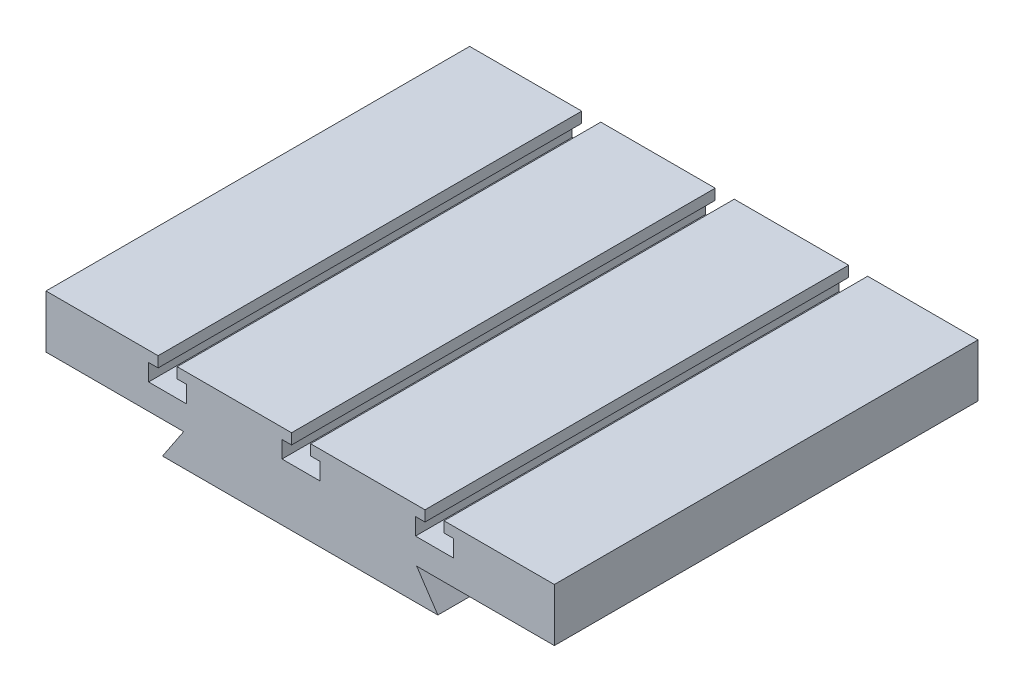
ISO-10303-21;
HEADER;
FILE_DESCRIPTION(('STEP AP214'),'2;1');
FILE_NAME('part.step','',(''),(''),'','','');
FILE_SCHEMA(('AUTOMOTIVE_DESIGN { 1 0 10303 214 1 1 1 1 }'));
ENDSEC;
DATA;
#1=APPLICATION_CONTEXT('core data for automotive mechanical design processes');
#2=APPLICATION_PROTOCOL_DEFINITION('international standard','automotive_design',2000,#1);
#3=PRODUCT_CONTEXT('',#1,'mechanical');
#4=PRODUCT('Part','Part','',(#3));
#5=PRODUCT_RELATED_PRODUCT_CATEGORY('part','',(#4));
#6=PRODUCT_DEFINITION_FORMATION('','',#4);
#7=PRODUCT_DEFINITION_CONTEXT('part definition',#1,'design');
#8=PRODUCT_DEFINITION('design','',#6,#7);
#9=PRODUCT_DEFINITION_SHAPE('','',#8);
#10=(LENGTH_UNIT() NAMED_UNIT(*) SI_UNIT(.MILLI.,.METRE.));
#11=(NAMED_UNIT(*) PLANE_ANGLE_UNIT() SI_UNIT($,.RADIAN.));
#12=(NAMED_UNIT(*) SI_UNIT($,.STERADIAN.) SOLID_ANGLE_UNIT());
#13=UNCERTAINTY_MEASURE_WITH_UNIT(LENGTH_MEASURE(1.E-05),#10,'distance_accuracy_value','');
#14=(GEOMETRIC_REPRESENTATION_CONTEXT(3) GLOBAL_UNCERTAINTY_ASSIGNED_CONTEXT((#13)) GLOBAL_UNIT_ASSIGNED_CONTEXT((#10,
#11,#12)) REPRESENTATION_CONTEXT('',''));
#15=CARTESIAN_POINT('',(0.,0.,0.));
#16=DIRECTION('',(0.,0.,1.));
#17=DIRECTION('',(1.,0.,0.));
#18=AXIS2_PLACEMENT_3D('',#15,#16,#17);
#19=CARTESIAN_POINT('',(-120.,40.,200.));
#20=DIRECTION('',(0.,-1.,0.));
#21=DIRECTION('',(0.,0.,-1.));
#22=AXIS2_PLACEMENT_3D('',#19,#20,#21);
#23=PLANE('',#22);
#24=DIRECTION('',(-1.,0.,0.));
#25=VECTOR('',#24,1.);
#26=CARTESIAN_POINT('',(120.,40.,200.));
#27=LINE('',#26,#25);
#28=CARTESIAN_POINT('',(58.9261789790718,40.,200.));
#29=VERTEX_POINT('',#28);
#30=CARTESIAN_POINT('',(4.92617897907182,40.,200.));
#31=VERTEX_POINT('',#30);
#32=EDGE_CURVE('E437',#29,#31,#27,.T.);
#33=ORIENTED_EDGE('',*,*,#32,.F.);
#34=DIRECTION('',(0.,0.,1.));
#35=VECTOR('',#34,1.);
#36=CARTESIAN_POINT('',(58.9261789790718,40.,0.));
#37=LINE('',#36,#35);
#38=CARTESIAN_POINT('',(58.9261789790718,40.,0.));
#39=VERTEX_POINT('',#38);
#40=EDGE_CURVE('E357',#39,#29,#37,.T.);
#41=ORIENTED_EDGE('',*,*,#40,.F.);
#42=DIRECTION('',(-1.,0.,0.));
#43=VECTOR('',#42,1.);
#44=CARTESIAN_POINT('',(-120.,40.,0.));
#45=LINE('',#44,#43);
#46=CARTESIAN_POINT('',(4.92617897907182,40.,0.));
#47=VERTEX_POINT('',#46);
#48=EDGE_CURVE('E457',#39,#47,#45,.T.);
#49=ORIENTED_EDGE('',*,*,#48,.T.);
#50=DIRECTION('',(0.,0.,1.));
#51=VECTOR('',#50,1.);
#52=CARTESIAN_POINT('',(4.92617897907182,40.,0.));
#53=LINE('',#52,#51);
#54=EDGE_CURVE('E417',#47,#31,#53,.T.);
#55=ORIENTED_EDGE('',*,*,#54,.T.);
#56=EDGE_LOOP('',(#33,#41,#49,#55));
#57=FACE_BOUND('',#56,.T.);
#58=ADVANCED_FACE('F34',(#57),#23,.F.);
#59=CARTESIAN_POINT('',(-67.0738210209282,39.9999999999987,200.));
#60=VERTEX_POINT('',#59);
#61=CARTESIAN_POINT('',(-120.,40.,200.));
#62=VERTEX_POINT('',#61);
#63=EDGE_CURVE('E432',#60,#62,#27,.T.);
#64=ORIENTED_EDGE('',*,*,#63,.F.);
#65=DIRECTION('',(0.,0.,1.));
#66=VECTOR('',#65,1.);
#67=CARTESIAN_POINT('',(-67.0738210209282,39.9999999999987,0.));
#68=LINE('',#67,#66);
#69=CARTESIAN_POINT('',(-67.0738210209282,39.9999999999987,0.));
#70=VERTEX_POINT('',#69);
#71=EDGE_CURVE('E305',#70,#60,#68,.T.);
#72=ORIENTED_EDGE('',*,*,#71,.F.);
#73=CARTESIAN_POINT('',(-120.,40.,0.));
#74=VERTEX_POINT('',#73);
#75=EDGE_CURVE('E452',#70,#74,#45,.T.);
#76=ORIENTED_EDGE('',*,*,#75,.T.);
#77=DIRECTION('',(0.,0.,-1.));
#78=VECTOR('',#77,1.);
#79=CARTESIAN_POINT('',(-120.,40.,200.));
#80=LINE('',#79,#78);
#81=EDGE_CURVE('E471',#62,#74,#80,.T.);
#82=ORIENTED_EDGE('',*,*,#81,.F.);
#83=EDGE_LOOP('',(#64,#72,#76,#82));
#84=FACE_BOUND('',#83,.T.);
#85=ADVANCED_FACE('F525',(#84),#23,.F.);
#86=CARTESIAN_POINT('',(-4.07382102092818,40.,0.));
#87=VERTEX_POINT('',#86);
#88=CARTESIAN_POINT('',(-58.0738210209282,39.9999999999987,0.));
#89=VERTEX_POINT('',#88);
#90=EDGE_CURVE('E527',#87,#89,#45,.T.);
#91=ORIENTED_EDGE('',*,*,#90,.T.);
#92=DIRECTION('',(0.,0.,1.));
#93=VECTOR('',#92,1.);
#94=CARTESIAN_POINT('',(-58.0738210209282,39.9999999999987,0.));
#95=LINE('',#94,#93);
#96=CARTESIAN_POINT('',(-58.0738210209282,39.9999999999987,200.));
#97=VERTEX_POINT('',#96);
#98=EDGE_CURVE('E307',#89,#97,#95,.T.);
#99=ORIENTED_EDGE('',*,*,#98,.T.);
#100=CARTESIAN_POINT('',(-4.07382102092818,40.,200.));
#101=VERTEX_POINT('',#100);
#102=EDGE_CURVE('E548',#101,#97,#27,.T.);
#103=ORIENTED_EDGE('',*,*,#102,.F.);
#104=DIRECTION('',(0.,0.,1.));
#105=VECTOR('',#104,1.);
#106=CARTESIAN_POINT('',(-4.07382102092818,40.,0.));
#107=LINE('',#106,#105);
#108=EDGE_CURVE('E415',#87,#101,#107,.T.);
#109=ORIENTED_EDGE('',*,*,#108,.F.);
#110=EDGE_LOOP('',(#91,#99,#103,#109));
#111=FACE_BOUND('',#110,.T.);
#112=ADVANCED_FACE('F568',(#111),#23,.F.);
#113=CARTESIAN_POINT('',(0.,0.,200.));
#114=DIRECTION('',(0.,1.,0.));
#115=DIRECTION('',(-1.,0.,0.));
#116=AXIS2_PLACEMENT_3D('',#113,#114,#115);
#117=PLANE('',#116);
#118=DIRECTION('',(1.,0.,0.));
#119=VECTOR('',#118,1.);
#120=CARTESIAN_POINT('',(0.,0.,0.));
#121=LINE('',#120,#119);
#122=CARTESIAN_POINT('',(-65.,0.,0.));
#123=VERTEX_POINT('',#122);
#124=CARTESIAN_POINT('',(65.,0.,0.));
#125=VERTEX_POINT('',#124);
#126=EDGE_CURVE('E408',#123,#125,#121,.T.);
#127=ORIENTED_EDGE('',*,*,#126,.T.);
#128=DIRECTION('',(0.,0.,-1.));
#129=VECTOR('',#128,1.);
#130=CARTESIAN_POINT('',(65.,0.,200.));
#131=LINE('',#130,#129);
#132=CARTESIAN_POINT('',(65.,0.,200.));
#133=VERTEX_POINT('',#132);
#134=EDGE_CURVE('E11',#133,#125,#131,.T.);
#135=ORIENTED_EDGE('',*,*,#134,.F.);
#136=DIRECTION('',(1.,0.,0.));
#137=VECTOR('',#136,1.);
#138=CARTESIAN_POINT('',(0.,0.,200.));
#139=LINE('',#138,#137);
#140=CARTESIAN_POINT('',(-65.,0.,200.));
#141=VERTEX_POINT('',#140);
#142=EDGE_CURVE('E423',#141,#133,#139,.T.);
#143=ORIENTED_EDGE('',*,*,#142,.F.);
#144=DIRECTION('',(0.,0.,-1.));
#145=VECTOR('',#144,1.);
#146=CARTESIAN_POINT('',(-65.,0.,200.));
#147=LINE('',#146,#145);
#148=EDGE_CURVE('E443',#141,#123,#147,.T.);
#149=ORIENTED_EDGE('',*,*,#148,.T.);
#150=EDGE_LOOP('',(#127,#135,#143,#149));
#151=FACE_BOUND('',#150,.T.);
#152=ADVANCED_FACE('F36',(#151),#117,.F.);
#153=CARTESIAN_POINT('',(65.,0.,200.));
#154=DIRECTION('',(-0.832050294337843,-0.554700196225229,0.));
#155=DIRECTION('',(0.554700196225229,-0.832050294337844,0.));
#156=AXIS2_PLACEMENT_3D('',#153,#154,#155);
#157=PLANE('',#156);
#158=DIRECTION('',(-0.554700196225229,0.832050294337843,0.));
#159=VECTOR('',#158,1.);
#160=CARTESIAN_POINT('',(65.,0.,0.));
#161=LINE('',#160,#159);
#162=CARTESIAN_POINT('',(55.,15.,0.));
#163=VERTEX_POINT('',#162);
#164=EDGE_CURVE('E445',#125,#163,#161,.T.);
#165=ORIENTED_EDGE('',*,*,#164,.T.);
#166=DIRECTION('',(0.,0.,-1.));
#167=VECTOR('',#166,1.);
#168=CARTESIAN_POINT('',(55.,15.,200.));
#169=LINE('',#168,#167);
#170=CARTESIAN_POINT('',(55.,15.,200.));
#171=VERTEX_POINT('',#170);
#172=EDGE_CURVE('E42',#171,#163,#169,.T.);
#173=ORIENTED_EDGE('',*,*,#172,.F.);
#174=DIRECTION('',(-0.554700196225229,0.832050294337843,0.));
#175=VECTOR('',#174,1.);
#176=CARTESIAN_POINT('',(65.,0.,200.));
#177=LINE('',#176,#175);
#178=EDGE_CURVE('E425',#133,#171,#177,.T.);
#179=ORIENTED_EDGE('',*,*,#178,.F.);
#180=ORIENTED_EDGE('',*,*,#134,.T.);
#181=EDGE_LOOP('',(#165,#173,#179,#180));
#182=FACE_BOUND('',#181,.T.);
#183=ADVANCED_FACE('F504',(#182),#157,.F.);
#184=CARTESIAN_POINT('',(55.,15.,200.));
#185=DIRECTION('',(0.,1.,0.));
#186=DIRECTION('',(-1.,0.,0.));
#187=AXIS2_PLACEMENT_3D('',#184,#185,#186);
#188=PLANE('',#187);
#189=DIRECTION('',(1.,0.,0.));
#190=VECTOR('',#189,1.);
#191=CARTESIAN_POINT('',(55.,15.,0.));
#192=LINE('',#191,#190);
#193=CARTESIAN_POINT('',(120.,15.,0.));
#194=VERTEX_POINT('',#193);
#195=EDGE_CURVE('E447',#163,#194,#192,.T.);
#196=ORIENTED_EDGE('',*,*,#195,.T.);
#197=DIRECTION('',(0.,0.,-1.));
#198=VECTOR('',#197,1.);
#199=CARTESIAN_POINT('',(120.,15.,200.));
#200=LINE('',#199,#198);
#201=CARTESIAN_POINT('',(120.,15.,200.));
#202=VERTEX_POINT('',#201);
#203=EDGE_CURVE('E477',#202,#194,#200,.T.);
#204=ORIENTED_EDGE('',*,*,#203,.F.);
#205=DIRECTION('',(1.,0.,0.));
#206=VECTOR('',#205,1.);
#207=CARTESIAN_POINT('',(55.,15.,200.));
#208=LINE('',#207,#206);
#209=EDGE_CURVE('E428',#171,#202,#208,.T.);
#210=ORIENTED_EDGE('',*,*,#209,.F.);
#211=ORIENTED_EDGE('',*,*,#172,.T.);
#212=EDGE_LOOP('',(#196,#204,#210,#211));
#213=FACE_BOUND('',#212,.T.);
#214=ADVANCED_FACE('F484',(#213),#188,.F.);
#215=CARTESIAN_POINT('',(120.,15.,200.));
#216=DIRECTION('',(-1.,0.,0.));
#217=DIRECTION('',(0.,-1.,0.));
#218=AXIS2_PLACEMENT_3D('',#215,#216,#217);
#219=PLANE('',#218);
#220=DIRECTION('',(0.,1.,0.));
#221=VECTOR('',#220,1.);
#222=CARTESIAN_POINT('',(120.,15.,0.));
#223=LINE('',#222,#221);
#224=CARTESIAN_POINT('',(120.,40.,0.));
#225=VERTEX_POINT('',#224);
#226=EDGE_CURVE('E449',#194,#225,#223,.T.);
#227=ORIENTED_EDGE('',*,*,#226,.T.);
#228=DIRECTION('',(0.,0.,-1.));
#229=VECTOR('',#228,1.);
#230=CARTESIAN_POINT('',(120.,40.,200.));
#231=LINE('',#230,#229);
#232=CARTESIAN_POINT('',(120.,40.,200.));
#233=VERTEX_POINT('',#232);
#234=EDGE_CURVE('E474',#233,#225,#231,.T.);
#235=ORIENTED_EDGE('',*,*,#234,.F.);
#236=DIRECTION('',(0.,1.,0.));
#237=VECTOR('',#236,1.);
#238=CARTESIAN_POINT('',(120.,15.,200.));
#239=LINE('',#238,#237);
#240=EDGE_CURVE('E430',#202,#233,#239,.T.);
#241=ORIENTED_EDGE('',*,*,#240,.F.);
#242=ORIENTED_EDGE('',*,*,#203,.T.);
#243=EDGE_LOOP('',(#227,#235,#241,#242));
#244=FACE_BOUND('',#243,.T.);
#245=ADVANCED_FACE('F492',(#244),#219,.F.);
#246=CARTESIAN_POINT('',(67.9261789790718,40.,0.));
#247=VERTEX_POINT('',#246);
#248=EDGE_CURVE('E453',#225,#247,#45,.T.);
#249=ORIENTED_EDGE('',*,*,#248,.T.);
#250=DIRECTION('',(0.,0.,1.));
#251=VECTOR('',#250,1.);
#252=CARTESIAN_POINT('',(67.9261789790718,40.,0.));
#253=LINE('',#252,#251);
#254=CARTESIAN_POINT('',(67.9261789790718,40.,200.));
#255=VERTEX_POINT('',#254);
#256=EDGE_CURVE('E359',#247,#255,#253,.T.);
#257=ORIENTED_EDGE('',*,*,#256,.T.);
#258=EDGE_CURVE('E433',#233,#255,#27,.T.);
#259=ORIENTED_EDGE('',*,*,#258,.F.);
#260=ORIENTED_EDGE('',*,*,#234,.T.);
#261=EDGE_LOOP('',(#249,#257,#259,#260));
#262=FACE_BOUND('',#261,.T.);
#263=ADVANCED_FACE('F496',(#262),#23,.F.);
#264=CARTESIAN_POINT('',(-120.,15.,200.));
#265=DIRECTION('',(1.,0.,0.));
#266=DIRECTION('',(0.,1.,0.));
#267=AXIS2_PLACEMENT_3D('',#264,#265,#266);
#268=PLANE('',#267);
#269=DIRECTION('',(0.,-1.,0.));
#270=VECTOR('',#269,1.);
#271=CARTESIAN_POINT('',(-120.,15.,0.));
#272=LINE('',#271,#270);
#273=CARTESIAN_POINT('',(-120.,15.,0.));
#274=VERTEX_POINT('',#273);
#275=EDGE_CURVE('E456',#74,#274,#272,.T.);
#276=ORIENTED_EDGE('',*,*,#275,.T.);
#277=DIRECTION('',(0.,0.,-1.));
#278=VECTOR('',#277,1.);
#279=CARTESIAN_POINT('',(-120.,15.,200.));
#280=LINE('',#279,#278);
#281=CARTESIAN_POINT('',(-120.,15.,200.));
#282=VERTEX_POINT('',#281);
#283=EDGE_CURVE('E468',#282,#274,#280,.T.);
#284=ORIENTED_EDGE('',*,*,#283,.F.);
#285=DIRECTION('',(0.,-1.,0.));
#286=VECTOR('',#285,1.);
#287=CARTESIAN_POINT('',(-120.,15.,200.));
#288=LINE('',#287,#286);
#289=EDGE_CURVE('E436',#62,#282,#288,.T.);
#290=ORIENTED_EDGE('',*,*,#289,.F.);
#291=ORIENTED_EDGE('',*,*,#81,.T.);
#292=EDGE_LOOP('',(#276,#284,#290,#291));
#293=FACE_BOUND('',#292,.T.);
#294=ADVANCED_FACE('F520',(#293),#268,.F.);
#295=CARTESIAN_POINT('',(-55.,15.,200.));
#296=DIRECTION('',(0.,1.,0.));
#297=DIRECTION('',(-1.,0.,0.));
#298=AXIS2_PLACEMENT_3D('',#295,#296,#297);
#299=PLANE('',#298);
#300=DIRECTION('',(1.,0.,0.));
#301=VECTOR('',#300,1.);
#302=CARTESIAN_POINT('',(-55.,15.,0.));
#303=LINE('',#302,#301);
#304=CARTESIAN_POINT('',(-55.,15.,0.));
#305=VERTEX_POINT('',#304);
#306=EDGE_CURVE('E459',#274,#305,#303,.T.);
#307=ORIENTED_EDGE('',*,*,#306,.T.);
#308=DIRECTION('',(0.,0.,-1.));
#309=VECTOR('',#308,1.);
#310=CARTESIAN_POINT('',(-55.,15.,200.));
#311=LINE('',#310,#309);
#312=CARTESIAN_POINT('',(-55.,15.,200.));
#313=VERTEX_POINT('',#312);
#314=EDGE_CURVE('E465',#313,#305,#311,.T.);
#315=ORIENTED_EDGE('',*,*,#314,.F.);
#316=DIRECTION('',(1.,0.,0.));
#317=VECTOR('',#316,1.);
#318=CARTESIAN_POINT('',(-55.,15.,200.));
#319=LINE('',#318,#317);
#320=EDGE_CURVE('E439',#282,#313,#319,.T.);
#321=ORIENTED_EDGE('',*,*,#320,.F.);
#322=ORIENTED_EDGE('',*,*,#283,.T.);
#323=EDGE_LOOP('',(#307,#315,#321,#322));
#324=FACE_BOUND('',#323,.T.);
#325=ADVANCED_FACE('F515',(#324),#299,.F.);
#326=CARTESIAN_POINT('',(-65.,0.,200.));
#327=DIRECTION('',(0.832050294337844,-0.554700196225228,0.));
#328=DIRECTION('',(0.554700196225228,0.832050294337844,0.));
#329=AXIS2_PLACEMENT_3D('',#326,#327,#328);
#330=PLANE('',#329);
#331=DIRECTION('',(-0.554700196225228,-0.832050294337844,0.));
#332=VECTOR('',#331,1.);
#333=CARTESIAN_POINT('',(-65.,0.,0.));
#334=LINE('',#333,#332);
#335=EDGE_CURVE('E426',#305,#123,#334,.T.);
#336=ORIENTED_EDGE('',*,*,#335,.T.);
#337=ORIENTED_EDGE('',*,*,#148,.F.);
#338=DIRECTION('',(-0.554700196225228,-0.832050294337844,0.));
#339=VECTOR('',#338,1.);
#340=CARTESIAN_POINT('',(-65.,0.,200.));
#341=LINE('',#340,#339);
#342=EDGE_CURVE('E441',#313,#141,#341,.T.);
#343=ORIENTED_EDGE('',*,*,#342,.F.);
#344=ORIENTED_EDGE('',*,*,#314,.T.);
#345=EDGE_LOOP('',(#336,#337,#343,#344));
#346=FACE_BOUND('',#345,.T.);
#347=ADVANCED_FACE('F510',(#346),#330,.F.);
#348=CARTESIAN_POINT('',(0.,0.,200.));
#349=DIRECTION('',(0.,0.,-1.));
#350=DIRECTION('',(-1.,0.,0.));
#351=AXIS2_PLACEMENT_3D('',#348,#349,#350);
#352=PLANE('',#351);
#353=DIRECTION('',(-1.,0.,0.));
#354=VECTOR('',#353,1.);
#355=CARTESIAN_POINT('',(58.9261789790718,35.,200.));
#356=LINE('',#355,#354);
#357=CARTESIAN_POINT('',(58.9261789790718,35.,200.));
#358=VERTEX_POINT('',#357);
#359=CARTESIAN_POINT('',(54.4261789790718,35.,200.));
#360=VERTEX_POINT('',#359);
#361=EDGE_CURVE('E342',#358,#360,#356,.T.);
#362=ORIENTED_EDGE('',*,*,#361,.F.);
#363=DIRECTION('',(0.,-1.,0.));
#364=VECTOR('',#363,1.);
#365=CARTESIAN_POINT('',(58.9261789790718,40.,200.));
#366=LINE('',#365,#364);
#367=EDGE_CURVE('E339',#29,#358,#366,.T.);
#368=ORIENTED_EDGE('',*,*,#367,.F.);
#369=ORIENTED_EDGE('',*,*,#32,.T.);
#370=DIRECTION('',(0.,1.,0.));
#371=VECTOR('',#370,1.);
#372=CARTESIAN_POINT('',(4.92617897907182,35.,200.));
#373=LINE('',#372,#371);
#374=CARTESIAN_POINT('',(4.92617897907182,35.,200.));
#375=VERTEX_POINT('',#374);
#376=EDGE_CURVE('E393',#375,#31,#373,.T.);
#377=ORIENTED_EDGE('',*,*,#376,.F.);
#378=DIRECTION('',(-1.,0.,0.));
#379=VECTOR('',#378,1.);
#380=CARTESIAN_POINT('',(9.42617897907182,35.,200.));
#381=LINE('',#380,#379);
#382=CARTESIAN_POINT('',(9.42617897907182,35.,200.));
#383=VERTEX_POINT('',#382);
#384=EDGE_CURVE('E390',#383,#375,#381,.T.);
#385=ORIENTED_EDGE('',*,*,#384,.F.);
#386=DIRECTION('',(0.,1.,0.));
#387=VECTOR('',#386,1.);
#388=CARTESIAN_POINT('',(9.42617897907182,27.,200.));
#389=LINE('',#388,#387);
#390=CARTESIAN_POINT('',(9.42617897907182,27.,200.));
#391=VERTEX_POINT('',#390);
#392=EDGE_CURVE('E298',#391,#383,#389,.T.);
#393=ORIENTED_EDGE('',*,*,#392,.F.);
#394=DIRECTION('',(1.,0.,0.));
#395=VECTOR('',#394,1.);
#396=CARTESIAN_POINT('',(-8.57382102092818,27.,200.));
#397=LINE('',#396,#395);
#398=CARTESIAN_POINT('',(-8.57382102092818,27.,200.));
#399=VERTEX_POINT('',#398);
#400=EDGE_CURVE('E369',#399,#391,#397,.T.);
#401=ORIENTED_EDGE('',*,*,#400,.F.);
#402=DIRECTION('',(0.,-1.,0.));
#403=VECTOR('',#402,1.);
#404=CARTESIAN_POINT('',(-8.57382102092819,35.,200.));
#405=LINE('',#404,#403);
#406=CARTESIAN_POINT('',(-8.57382102092819,35.,200.));
#407=VERTEX_POINT('',#406);
#408=EDGE_CURVE('E401',#407,#399,#405,.T.);
#409=ORIENTED_EDGE('',*,*,#408,.F.);
#410=DIRECTION('',(-1.,0.,0.));
#411=VECTOR('',#410,1.);
#412=CARTESIAN_POINT('',(-4.07382102092818,35.,200.));
#413=LINE('',#412,#411);
#414=CARTESIAN_POINT('',(-4.07382102092818,35.,200.));
#415=VERTEX_POINT('',#414);
#416=EDGE_CURVE('E398',#415,#407,#413,.T.);
#417=ORIENTED_EDGE('',*,*,#416,.F.);
#418=DIRECTION('',(0.,-1.,0.));
#419=VECTOR('',#418,1.);
#420=CARTESIAN_POINT('',(-4.07382102092818,40.,200.));
#421=LINE('',#420,#419);
#422=EDGE_CURVE('E395',#101,#415,#421,.T.);
#423=ORIENTED_EDGE('',*,*,#422,.F.);
#424=ORIENTED_EDGE('',*,*,#102,.T.);
#425=DIRECTION('',(0.,1.,0.));
#426=VECTOR('',#425,1.);
#427=CARTESIAN_POINT('',(-58.0738210209282,34.9999999999987,200.));
#428=LINE('',#427,#426);
#429=CARTESIAN_POINT('',(-58.0738210209282,34.9999999999987,200.));
#430=VERTEX_POINT('',#429);
#431=EDGE_CURVE('E286',#430,#97,#428,.T.);
#432=ORIENTED_EDGE('',*,*,#431,.F.);
#433=DIRECTION('',(-1.,0.,0.));
#434=VECTOR('',#433,1.);
#435=CARTESIAN_POINT('',(-53.5738210209282,34.9999999999987,200.));
#436=LINE('',#435,#434);
#437=CARTESIAN_POINT('',(-53.5738210209282,34.9999999999987,200.));
#438=VERTEX_POINT('',#437);
#439=EDGE_CURVE('E283',#438,#430,#436,.T.);
#440=ORIENTED_EDGE('',*,*,#439,.F.);
#441=DIRECTION('',(0.,1.,0.));
#442=VECTOR('',#441,1.);
#443=CARTESIAN_POINT('',(-53.5738210209282,26.9999999999987,200.));
#444=LINE('',#443,#442);
#445=CARTESIAN_POINT('',(-53.5738210209282,26.9999999999987,200.));
#446=VERTEX_POINT('',#445);
#447=EDGE_CURVE('E250',#446,#438,#444,.T.);
#448=ORIENTED_EDGE('',*,*,#447,.F.);
#449=DIRECTION('',(1.,0.,0.));
#450=VECTOR('',#449,1.);
#451=CARTESIAN_POINT('',(-71.5738210209282,26.9999999999987,200.));
#452=LINE('',#451,#450);
#453=CARTESIAN_POINT('',(-71.5738210209282,26.9999999999987,200.));
#454=VERTEX_POINT('',#453);
#455=EDGE_CURVE('E266',#454,#446,#452,.T.);
#456=ORIENTED_EDGE('',*,*,#455,.F.);
#457=DIRECTION('',(0.,-1.,0.));
#458=VECTOR('',#457,1.);
#459=CARTESIAN_POINT('',(-71.5738210209282,34.9999999999987,200.));
#460=LINE('',#459,#458);
#461=CARTESIAN_POINT('',(-71.5738210209282,34.9999999999987,200.));
#462=VERTEX_POINT('',#461);
#463=EDGE_CURVE('E269',#462,#454,#460,.T.);
#464=ORIENTED_EDGE('',*,*,#463,.F.);
#465=DIRECTION('',(-1.,0.,0.));
#466=VECTOR('',#465,1.);
#467=CARTESIAN_POINT('',(-67.0738210209282,34.9999999999987,200.));
#468=LINE('',#467,#466);
#469=CARTESIAN_POINT('',(-67.0738210209282,34.9999999999987,200.));
#470=VERTEX_POINT('',#469);
#471=EDGE_CURVE('E291',#470,#462,#468,.T.);
#472=ORIENTED_EDGE('',*,*,#471,.F.);
#473=DIRECTION('',(0.,-1.,0.));
#474=VECTOR('',#473,1.);
#475=CARTESIAN_POINT('',(-67.0738210209282,39.9999999999987,200.));
#476=LINE('',#475,#474);
#477=EDGE_CURVE('E288',#60,#470,#476,.T.);
#478=ORIENTED_EDGE('',*,*,#477,.F.);
#479=ORIENTED_EDGE('',*,*,#63,.T.);
#480=ORIENTED_EDGE('',*,*,#289,.T.);
#481=ORIENTED_EDGE('',*,*,#320,.T.);
#482=ORIENTED_EDGE('',*,*,#342,.T.);
#483=ORIENTED_EDGE('',*,*,#142,.T.);
#484=ORIENTED_EDGE('',*,*,#178,.T.);
#485=ORIENTED_EDGE('',*,*,#209,.T.);
#486=ORIENTED_EDGE('',*,*,#240,.T.);
#487=ORIENTED_EDGE('',*,*,#258,.T.);
#488=DIRECTION('',(0.,1.,0.));
#489=VECTOR('',#488,1.);
#490=CARTESIAN_POINT('',(67.9261789790718,35.,200.));
#491=LINE('',#490,#489);
#492=CARTESIAN_POINT('',(67.9261789790718,35.,200.));
#493=VERTEX_POINT('',#492);
#494=EDGE_CURVE('E337',#493,#255,#491,.T.);
#495=ORIENTED_EDGE('',*,*,#494,.F.);
#496=DIRECTION('',(-1.,0.,0.));
#497=VECTOR('',#496,1.);
#498=CARTESIAN_POINT('',(72.4261789790718,35.,200.));
#499=LINE('',#498,#497);
#500=CARTESIAN_POINT('',(72.4261789790718,35.,200.));
#501=VERTEX_POINT('',#500);
#502=EDGE_CURVE('E334',#501,#493,#499,.T.);
#503=ORIENTED_EDGE('',*,*,#502,.F.);
#504=DIRECTION('',(0.,1.,0.));
#505=VECTOR('',#504,1.);
#506=CARTESIAN_POINT('',(72.4261789790718,27.,200.));
#507=LINE('',#506,#505);
#508=CARTESIAN_POINT('',(72.4261789790718,27.,200.));
#509=VERTEX_POINT('',#508);
#510=EDGE_CURVE('E331',#509,#501,#507,.T.);
#511=ORIENTED_EDGE('',*,*,#510,.F.);
#512=DIRECTION('',(1.,0.,0.));
#513=VECTOR('',#512,1.);
#514=CARTESIAN_POINT('',(54.4261789790718,27.,200.));
#515=LINE('',#514,#513);
#516=CARTESIAN_POINT('',(54.4261789790718,27.,200.));
#517=VERTEX_POINT('',#516);
#518=EDGE_CURVE('E315',#517,#509,#515,.T.);
#519=ORIENTED_EDGE('',*,*,#518,.F.);
#520=DIRECTION('',(0.,-1.,0.));
#521=VECTOR('',#520,1.);
#522=CARTESIAN_POINT('',(54.4261789790718,35.,200.));
#523=LINE('',#522,#521);
#524=EDGE_CURVE('E345',#360,#517,#523,.T.);
#525=ORIENTED_EDGE('',*,*,#524,.F.);
#526=EDGE_LOOP('',(#362,#368,#369,#377,#385,#393,#401,#409,#417,#423,#424,#432,#440,#448,#456,
#464,#472,#478,#479,#480,#481,#482,#483,#484,#485,#486,#487,#495,#503,#511,#519,#525));
#527=FACE_BOUND('',#526,.T.);
#528=ADVANCED_FACE('F500',(#527),#352,.F.);
#529=CARTESIAN_POINT('',(0.,0.,0.));
#530=DIRECTION('',(0.,0.,-1.));
#531=DIRECTION('',(-1.,0.,0.));
#532=AXIS2_PLACEMENT_3D('',#529,#530,#531);
#533=PLANE('',#532);
#534=DIRECTION('',(0.,-1.,0.));
#535=VECTOR('',#534,1.);
#536=CARTESIAN_POINT('',(58.9261789790718,40.,0.));
#537=LINE('',#536,#535);
#538=CARTESIAN_POINT('',(58.9261789790718,35.,0.));
#539=VERTEX_POINT('',#538);
#540=EDGE_CURVE('E319',#39,#539,#537,.T.);
#541=ORIENTED_EDGE('',*,*,#540,.T.);
#542=DIRECTION('',(-1.,0.,0.));
#543=VECTOR('',#542,1.);
#544=CARTESIAN_POINT('',(58.9261789790718,35.,0.));
#545=LINE('',#544,#543);
#546=CARTESIAN_POINT('',(54.4261789790718,35.,0.));
#547=VERTEX_POINT('',#546);
#548=EDGE_CURVE('E321',#539,#547,#545,.T.);
#549=ORIENTED_EDGE('',*,*,#548,.T.);
#550=DIRECTION('',(0.,-1.,0.));
#551=VECTOR('',#550,1.);
#552=CARTESIAN_POINT('',(54.4261789790718,35.,0.));
#553=LINE('',#552,#551);
#554=CARTESIAN_POINT('',(54.4261789790718,27.,0.));
#555=VERTEX_POINT('',#554);
#556=EDGE_CURVE('E324',#547,#555,#553,.T.);
#557=ORIENTED_EDGE('',*,*,#556,.T.);
#558=DIRECTION('',(1.,0.,0.));
#559=VECTOR('',#558,1.);
#560=CARTESIAN_POINT('',(54.4261789790718,27.,0.));
#561=LINE('',#560,#559);
#562=CARTESIAN_POINT('',(72.4261789790718,27.,0.));
#563=VERTEX_POINT('',#562);
#564=EDGE_CURVE('E327',#555,#563,#561,.T.);
#565=ORIENTED_EDGE('',*,*,#564,.T.);
#566=DIRECTION('',(0.,1.,0.));
#567=VECTOR('',#566,1.);
#568=CARTESIAN_POINT('',(72.4261789790718,27.,0.));
#569=LINE('',#568,#567);
#570=CARTESIAN_POINT('',(72.4261789790718,35.,0.));
#571=VERTEX_POINT('',#570);
#572=EDGE_CURVE('E311',#563,#571,#569,.T.);
#573=ORIENTED_EDGE('',*,*,#572,.T.);
#574=DIRECTION('',(-1.,0.,0.));
#575=VECTOR('',#574,1.);
#576=CARTESIAN_POINT('',(72.4261789790718,35.,0.));
#577=LINE('',#576,#575);
#578=CARTESIAN_POINT('',(67.9261789790718,35.,0.));
#579=VERTEX_POINT('',#578);
#580=EDGE_CURVE('E314',#571,#579,#577,.T.);
#581=ORIENTED_EDGE('',*,*,#580,.T.);
#582=DIRECTION('',(0.,1.,0.));
#583=VECTOR('',#582,1.);
#584=CARTESIAN_POINT('',(67.9261789790718,35.,0.));
#585=LINE('',#584,#583);
#586=EDGE_CURVE('E49',#579,#247,#585,.T.);
#587=ORIENTED_EDGE('',*,*,#586,.T.);
#588=ORIENTED_EDGE('',*,*,#248,.F.);
#589=ORIENTED_EDGE('',*,*,#226,.F.);
#590=ORIENTED_EDGE('',*,*,#195,.F.);
#591=ORIENTED_EDGE('',*,*,#164,.F.);
#592=ORIENTED_EDGE('',*,*,#126,.F.);
#593=ORIENTED_EDGE('',*,*,#335,.F.);
#594=ORIENTED_EDGE('',*,*,#306,.F.);
#595=ORIENTED_EDGE('',*,*,#275,.F.);
#596=ORIENTED_EDGE('',*,*,#75,.F.);
#597=DIRECTION('',(0.,-1.,0.));
#598=VECTOR('',#597,1.);
#599=CARTESIAN_POINT('',(-67.0738210209282,39.9999999999987,0.));
#600=LINE('',#599,#598);
#601=CARTESIAN_POINT('',(-67.0738210209282,34.9999999999987,0.));
#602=VERTEX_POINT('',#601);
#603=EDGE_CURVE('E273',#70,#602,#600,.T.);
#604=ORIENTED_EDGE('',*,*,#603,.T.);
#605=DIRECTION('',(-1.,0.,0.));
#606=VECTOR('',#605,1.);
#607=CARTESIAN_POINT('',(-67.0738210209282,34.9999999999987,0.));
#608=LINE('',#607,#606);
#609=CARTESIAN_POINT('',(-71.5738210209282,34.9999999999987,0.));
#610=VERTEX_POINT('',#609);
#611=EDGE_CURVE('E276',#602,#610,#608,.T.);
#612=ORIENTED_EDGE('',*,*,#611,.T.);
#613=DIRECTION('',(0.,-1.,0.));
#614=VECTOR('',#613,1.);
#615=CARTESIAN_POINT('',(-71.5738210209282,34.9999999999987,0.));
#616=LINE('',#615,#614);
#617=CARTESIAN_POINT('',(-71.5738210209282,26.9999999999987,0.));
#618=VERTEX_POINT('',#617);
#619=EDGE_CURVE('E279',#610,#618,#616,.T.);
#620=ORIENTED_EDGE('',*,*,#619,.T.);
#621=DIRECTION('',(1.,0.,0.));
#622=VECTOR('',#621,1.);
#623=CARTESIAN_POINT('',(-71.5738210209282,26.9999999999987,0.));
#624=LINE('',#623,#622);
#625=CARTESIAN_POINT('',(-53.5738210209282,26.9999999999987,0.));
#626=VERTEX_POINT('',#625);
#627=EDGE_CURVE('E255',#618,#626,#624,.T.);
#628=ORIENTED_EDGE('',*,*,#627,.T.);
#629=DIRECTION('',(0.,1.,0.));
#630=VECTOR('',#629,1.);
#631=CARTESIAN_POINT('',(-53.5738210209282,26.9999999999987,0.));
#632=LINE('',#631,#630);
#633=CARTESIAN_POINT('',(-53.5738210209282,34.9999999999987,0.));
#634=VERTEX_POINT('',#633);
#635=EDGE_CURVE('E247',#626,#634,#632,.T.);
#636=ORIENTED_EDGE('',*,*,#635,.T.);
#637=DIRECTION('',(-1.,0.,0.));
#638=VECTOR('',#637,1.);
#639=CARTESIAN_POINT('',(-53.5738210209282,34.9999999999987,0.));
#640=LINE('',#639,#638);
#641=CARTESIAN_POINT('',(-58.0738210209282,34.9999999999987,0.));
#642=VERTEX_POINT('',#641);
#643=EDGE_CURVE('E258',#634,#642,#640,.T.);
#644=ORIENTED_EDGE('',*,*,#643,.T.);
#645=DIRECTION('',(0.,1.,0.));
#646=VECTOR('',#645,1.);
#647=CARTESIAN_POINT('',(-58.0738210209282,34.9999999999987,0.));
#648=LINE('',#647,#646);
#649=EDGE_CURVE('E57',#642,#89,#648,.T.);
#650=ORIENTED_EDGE('',*,*,#649,.T.);
#651=ORIENTED_EDGE('',*,*,#90,.F.);
#652=DIRECTION('',(0.,-1.,0.));
#653=VECTOR('',#652,1.);
#654=CARTESIAN_POINT('',(-4.07382102092818,40.,0.));
#655=LINE('',#654,#653);
#656=CARTESIAN_POINT('',(-4.07382102092818,35.,0.));
#657=VERTEX_POINT('',#656);
#658=EDGE_CURVE('E375',#87,#657,#655,.T.);
#659=ORIENTED_EDGE('',*,*,#658,.T.);
#660=DIRECTION('',(-1.,0.,0.));
#661=VECTOR('',#660,1.);
#662=CARTESIAN_POINT('',(-4.07382102092818,35.,0.));
#663=LINE('',#662,#661);
#664=CARTESIAN_POINT('',(-8.57382102092819,35.,0.));
#665=VERTEX_POINT('',#664);
#666=EDGE_CURVE('E378',#657,#665,#663,.T.);
#667=ORIENTED_EDGE('',*,*,#666,.T.);
#668=DIRECTION('',(0.,-1.,0.));
#669=VECTOR('',#668,1.);
#670=CARTESIAN_POINT('',(-8.57382102092819,35.,0.));
#671=LINE('',#670,#669);
#672=CARTESIAN_POINT('',(-8.57382102092818,27.,0.));
#673=VERTEX_POINT('',#672);
#674=EDGE_CURVE('E381',#665,#673,#671,.T.);
#675=ORIENTED_EDGE('',*,*,#674,.T.);
#676=DIRECTION('',(1.,0.,0.));
#677=VECTOR('',#676,1.);
#678=CARTESIAN_POINT('',(-8.57382102092818,27.,0.));
#679=LINE('',#678,#677);
#680=CARTESIAN_POINT('',(9.42617897907182,27.,0.));
#681=VERTEX_POINT('',#680);
#682=EDGE_CURVE('E384',#673,#681,#679,.T.);
#683=ORIENTED_EDGE('',*,*,#682,.T.);
#684=DIRECTION('',(0.,1.,0.));
#685=VECTOR('',#684,1.);
#686=CARTESIAN_POINT('',(9.42617897907182,27.,0.));
#687=LINE('',#686,#685);
#688=CARTESIAN_POINT('',(9.42617897907182,35.,0.));
#689=VERTEX_POINT('',#688);
#690=EDGE_CURVE('E365',#681,#689,#687,.T.);
#691=ORIENTED_EDGE('',*,*,#690,.T.);
#692=DIRECTION('',(-1.,0.,0.));
#693=VECTOR('',#692,1.);
#694=CARTESIAN_POINT('',(9.42617897907182,35.,0.));
#695=LINE('',#694,#693);
#696=CARTESIAN_POINT('',(4.92617897907182,35.,0.));
#697=VERTEX_POINT('',#696);
#698=EDGE_CURVE('E368',#689,#697,#695,.T.);
#699=ORIENTED_EDGE('',*,*,#698,.T.);
#700=DIRECTION('',(0.,1.,0.));
#701=VECTOR('',#700,1.);
#702=CARTESIAN_POINT('',(4.92617897907182,35.,0.));
#703=LINE('',#702,#701);
#704=EDGE_CURVE('E372',#697,#47,#703,.T.);
#705=ORIENTED_EDGE('',*,*,#704,.T.);
#706=ORIENTED_EDGE('',*,*,#48,.F.);
#707=EDGE_LOOP('',(#541,#549,#557,#565,#573,#581,#587,#588,#589,#590,#591,#592,#593,#594,#595,
#596,#604,#612,#620,#628,#636,#644,#650,#651,#659,#667,#675,#683,#691,#699,#705,#706));
#708=FACE_BOUND('',#707,.T.);
#709=ADVANCED_FACE('F263',(#708),#533,.T.);
#710=CARTESIAN_POINT('',(9.42617897907182,27.,0.));
#711=DIRECTION('',(1.,0.,0.));
#712=DIRECTION('',(0.,1.,0.));
#713=AXIS2_PLACEMENT_3D('',#710,#711,#712);
#714=PLANE('',#713);
#715=ORIENTED_EDGE('',*,*,#392,.T.);
#716=DIRECTION('',(0.,0.,1.));
#717=VECTOR('',#716,1.);
#718=CARTESIAN_POINT('',(9.42617897907182,35.,0.));
#719=LINE('',#718,#717);
#720=EDGE_CURVE('E387',#689,#383,#719,.T.);
#721=ORIENTED_EDGE('',*,*,#720,.F.);
#722=ORIENTED_EDGE('',*,*,#690,.F.);
#723=DIRECTION('',(0.,0.,1.));
#724=VECTOR('',#723,1.);
#725=CARTESIAN_POINT('',(9.42617897907182,27.,0.));
#726=LINE('',#725,#724);
#727=EDGE_CURVE('E406',#681,#391,#726,.T.);
#728=ORIENTED_EDGE('',*,*,#727,.T.);
#729=EDGE_LOOP('',(#715,#721,#722,#728));
#730=FACE_BOUND('',#729,.T.);
#731=ADVANCED_FACE('F585',(#730),#714,.F.);
#732=CARTESIAN_POINT('',(-8.57382102092818,27.,0.));
#733=DIRECTION('',(0.,-1.,0.));
#734=DIRECTION('',(0.,0.,-1.));
#735=AXIS2_PLACEMENT_3D('',#732,#733,#734);
#736=PLANE('',#735);
#737=ORIENTED_EDGE('',*,*,#400,.T.);
#738=ORIENTED_EDGE('',*,*,#727,.F.);
#739=ORIENTED_EDGE('',*,*,#682,.F.);
#740=DIRECTION('',(0.,0.,1.));
#741=VECTOR('',#740,1.);
#742=CARTESIAN_POINT('',(-8.57382102092818,27.,0.));
#743=LINE('',#742,#741);
#744=EDGE_CURVE('E409',#673,#399,#743,.T.);
#745=ORIENTED_EDGE('',*,*,#744,.T.);
#746=EDGE_LOOP('',(#737,#738,#739,#745));
#747=FACE_BOUND('',#746,.T.);
#748=ADVANCED_FACE('F582',(#747),#736,.F.);
#749=CARTESIAN_POINT('',(-8.57382102092819,35.,0.));
#750=DIRECTION('',(-1.,0.,0.));
#751=DIRECTION('',(0.,-1.,0.));
#752=AXIS2_PLACEMENT_3D('',#749,#750,#751);
#753=PLANE('',#752);
#754=ORIENTED_EDGE('',*,*,#408,.T.);
#755=ORIENTED_EDGE('',*,*,#744,.F.);
#756=ORIENTED_EDGE('',*,*,#674,.F.);
#757=DIRECTION('',(0.,0.,1.));
#758=VECTOR('',#757,1.);
#759=CARTESIAN_POINT('',(-8.57382102092819,35.,0.));
#760=LINE('',#759,#758);
#761=EDGE_CURVE('E411',#665,#407,#760,.T.);
#762=ORIENTED_EDGE('',*,*,#761,.T.);
#763=EDGE_LOOP('',(#754,#755,#756,#762));
#764=FACE_BOUND('',#763,.T.);
#765=ADVANCED_FACE('F578',(#764),#753,.F.);
#766=CARTESIAN_POINT('',(-4.07382102092818,35.,0.));
#767=DIRECTION('',(0.,1.,0.));
#768=DIRECTION('',(0.,0.,1.));
#769=AXIS2_PLACEMENT_3D('',#766,#767,#768);
#770=PLANE('',#769);
#771=ORIENTED_EDGE('',*,*,#416,.T.);
#772=ORIENTED_EDGE('',*,*,#761,.F.);
#773=ORIENTED_EDGE('',*,*,#666,.F.);
#774=DIRECTION('',(0.,0.,1.));
#775=VECTOR('',#774,1.);
#776=CARTESIAN_POINT('',(-4.07382102092818,35.,0.));
#777=LINE('',#776,#775);
#778=EDGE_CURVE('E413',#657,#415,#777,.T.);
#779=ORIENTED_EDGE('',*,*,#778,.T.);
#780=EDGE_LOOP('',(#771,#772,#773,#779));
#781=FACE_BOUND('',#780,.T.);
#782=ADVANCED_FACE('F574',(#781),#770,.F.);
#783=CARTESIAN_POINT('',(-4.07382102092818,40.,0.));
#784=DIRECTION('',(-1.,0.,0.));
#785=DIRECTION('',(0.,0.,1.));
#786=AXIS2_PLACEMENT_3D('',#783,#784,#785);
#787=PLANE('',#786);
#788=ORIENTED_EDGE('',*,*,#422,.T.);
#789=ORIENTED_EDGE('',*,*,#778,.F.);
#790=ORIENTED_EDGE('',*,*,#658,.F.);
#791=ORIENTED_EDGE('',*,*,#108,.T.);
#792=EDGE_LOOP('',(#788,#789,#790,#791));
#793=FACE_BOUND('',#792,.T.);
#794=ADVANCED_FACE('F571',(#793),#787,.F.);
#795=CARTESIAN_POINT('',(4.92617897907182,35.,0.));
#796=DIRECTION('',(1.,0.,0.));
#797=DIRECTION('',(0.,0.,-1.));
#798=AXIS2_PLACEMENT_3D('',#795,#796,#797);
#799=PLANE('',#798);
#800=ORIENTED_EDGE('',*,*,#376,.T.);
#801=ORIENTED_EDGE('',*,*,#54,.F.);
#802=ORIENTED_EDGE('',*,*,#704,.F.);
#803=DIRECTION('',(0.,0.,1.));
#804=VECTOR('',#803,1.);
#805=CARTESIAN_POINT('',(4.92617897907182,35.,0.));
#806=LINE('',#805,#804);
#807=EDGE_CURVE('E420',#697,#375,#806,.T.);
#808=ORIENTED_EDGE('',*,*,#807,.T.);
#809=EDGE_LOOP('',(#800,#801,#802,#808));
#810=FACE_BOUND('',#809,.T.);
#811=ADVANCED_FACE('F541',(#810),#799,.F.);
#812=CARTESIAN_POINT('',(9.42617897907182,35.,0.));
#813=DIRECTION('',(0.,1.,0.));
#814=DIRECTION('',(0.,0.,1.));
#815=AXIS2_PLACEMENT_3D('',#812,#813,#814);
#816=PLANE('',#815);
#817=ORIENTED_EDGE('',*,*,#384,.T.);
#818=ORIENTED_EDGE('',*,*,#807,.F.);
#819=ORIENTED_EDGE('',*,*,#698,.F.);
#820=ORIENTED_EDGE('',*,*,#720,.T.);
#821=EDGE_LOOP('',(#817,#818,#819,#820));
#822=FACE_BOUND('',#821,.T.);
#823=ADVANCED_FACE('F543',(#822),#816,.F.);
#824=CARTESIAN_POINT('',(-53.5738210209282,26.9999999999987,0.));
#825=DIRECTION('',(1.,0.,0.));
#826=DIRECTION('',(0.,0.,-1.));
#827=AXIS2_PLACEMENT_3D('',#824,#825,#826);
#828=PLANE('',#827);
#829=ORIENTED_EDGE('',*,*,#447,.T.);
#830=DIRECTION('',(0.,0.,1.));
#831=VECTOR('',#830,1.);
#832=CARTESIAN_POINT('',(-53.5738210209282,34.9999999999987,0.));
#833=LINE('',#832,#831);
#834=EDGE_CURVE('E243',#634,#438,#833,.T.);
#835=ORIENTED_EDGE('',*,*,#834,.F.);
#836=ORIENTED_EDGE('',*,*,#635,.F.);
#837=DIRECTION('',(0.,0.,1.));
#838=VECTOR('',#837,1.);
#839=CARTESIAN_POINT('',(-53.5738210209282,26.9999999999987,0.));
#840=LINE('',#839,#838);
#841=EDGE_CURVE('E296',#626,#446,#840,.T.);
#842=ORIENTED_EDGE('',*,*,#841,.T.);
#843=EDGE_LOOP('',(#829,#835,#836,#842));
#844=FACE_BOUND('',#843,.T.);
#845=ADVANCED_FACE('F245',(#844),#828,.F.);
#846=CARTESIAN_POINT('',(-71.5738210209282,26.9999999999987,0.));
#847=DIRECTION('',(0.,-1.,0.));
#848=DIRECTION('',(0.,0.,-1.));
#849=AXIS2_PLACEMENT_3D('',#846,#847,#848);
#850=PLANE('',#849);
#851=ORIENTED_EDGE('',*,*,#455,.T.);
#852=ORIENTED_EDGE('',*,*,#841,.F.);
#853=ORIENTED_EDGE('',*,*,#627,.F.);
#854=DIRECTION('',(0.,0.,1.));
#855=VECTOR('',#854,1.);
#856=CARTESIAN_POINT('',(-71.5738210209282,26.9999999999987,0.));
#857=LINE('',#856,#855);
#858=EDGE_CURVE('E299',#618,#454,#857,.T.);
#859=ORIENTED_EDGE('',*,*,#858,.T.);
#860=EDGE_LOOP('',(#851,#852,#853,#859));
#861=FACE_BOUND('',#860,.T.);
#862=ADVANCED_FACE('F566',(#861),#850,.F.);
#863=CARTESIAN_POINT('',(-71.5738210209282,34.9999999999987,0.));
#864=DIRECTION('',(-1.,0.,0.));
#865=DIRECTION('',(0.,0.,1.));
#866=AXIS2_PLACEMENT_3D('',#863,#864,#865);
#867=PLANE('',#866);
#868=ORIENTED_EDGE('',*,*,#463,.T.);
#869=ORIENTED_EDGE('',*,*,#858,.F.);
#870=ORIENTED_EDGE('',*,*,#619,.F.);
#871=DIRECTION('',(0.,0.,1.));
#872=VECTOR('',#871,1.);
#873=CARTESIAN_POINT('',(-71.5738210209282,34.9999999999987,0.));
#874=LINE('',#873,#872);
#875=EDGE_CURVE('E301',#610,#462,#874,.T.);
#876=ORIENTED_EDGE('',*,*,#875,.T.);
#877=EDGE_LOOP('',(#868,#869,#870,#876));
#878=FACE_BOUND('',#877,.T.);
#879=ADVANCED_FACE('F563',(#878),#867,.F.);
#880=CARTESIAN_POINT('',(-67.0738210209282,34.9999999999987,0.));
#881=DIRECTION('',(0.,1.,0.));
#882=DIRECTION('',(0.,0.,1.));
#883=AXIS2_PLACEMENT_3D('',#880,#881,#882);
#884=PLANE('',#883);
#885=ORIENTED_EDGE('',*,*,#471,.T.);
#886=ORIENTED_EDGE('',*,*,#875,.F.);
#887=ORIENTED_EDGE('',*,*,#611,.F.);
#888=DIRECTION('',(0.,0.,1.));
#889=VECTOR('',#888,1.);
#890=CARTESIAN_POINT('',(-67.0738210209282,34.9999999999987,0.));
#891=LINE('',#890,#889);
#892=EDGE_CURVE('E303',#602,#470,#891,.T.);
#893=ORIENTED_EDGE('',*,*,#892,.T.);
#894=EDGE_LOOP('',(#885,#886,#887,#893));
#895=FACE_BOUND('',#894,.T.);
#896=ADVANCED_FACE('F561',(#895),#884,.F.);
#897=CARTESIAN_POINT('',(-67.0738210209282,39.9999999999987,0.));
#898=DIRECTION('',(-1.,0.,0.));
#899=DIRECTION('',(0.,0.,1.));
#900=AXIS2_PLACEMENT_3D('',#897,#898,#899);
#901=PLANE('',#900);
#902=ORIENTED_EDGE('',*,*,#477,.T.);
#903=ORIENTED_EDGE('',*,*,#892,.F.);
#904=ORIENTED_EDGE('',*,*,#603,.F.);
#905=ORIENTED_EDGE('',*,*,#71,.T.);
#906=EDGE_LOOP('',(#902,#903,#904,#905));
#907=FACE_BOUND('',#906,.T.);
#908=ADVANCED_FACE('F557',(#907),#901,.F.);
#909=CARTESIAN_POINT('',(-58.0738210209282,34.9999999999987,0.));
#910=DIRECTION('',(1.,0.,0.));
#911=DIRECTION('',(0.,0.,-1.));
#912=AXIS2_PLACEMENT_3D('',#909,#910,#911);
#913=PLANE('',#912);
#914=ORIENTED_EDGE('',*,*,#431,.T.);
#915=ORIENTED_EDGE('',*,*,#98,.F.);
#916=ORIENTED_EDGE('',*,*,#649,.F.);
#917=DIRECTION('',(0.,0.,1.));
#918=VECTOR('',#917,1.);
#919=CARTESIAN_POINT('',(-58.0738210209282,34.9999999999987,0.));
#920=LINE('',#919,#918);
#921=EDGE_CURVE('E254',#642,#430,#920,.T.);
#922=ORIENTED_EDGE('',*,*,#921,.T.);
#923=EDGE_LOOP('',(#914,#915,#916,#922));
#924=FACE_BOUND('',#923,.T.);
#925=ADVANCED_FACE('F567',(#924),#913,.F.);
#926=CARTESIAN_POINT('',(-53.5738210209282,34.9999999999987,0.));
#927=DIRECTION('',(0.,1.,0.));
#928=DIRECTION('',(0.,0.,1.));
#929=AXIS2_PLACEMENT_3D('',#926,#927,#928);
#930=PLANE('',#929);
#931=ORIENTED_EDGE('',*,*,#439,.T.);
#932=ORIENTED_EDGE('',*,*,#921,.F.);
#933=ORIENTED_EDGE('',*,*,#643,.F.);
#934=ORIENTED_EDGE('',*,*,#834,.T.);
#935=EDGE_LOOP('',(#931,#932,#933,#934));
#936=FACE_BOUND('',#935,.T.);
#937=ADVANCED_FACE('F259',(#936),#930,.F.);
#938=CARTESIAN_POINT('',(72.4261789790718,27.,0.));
#939=DIRECTION('',(1.,0.,0.));
#940=DIRECTION('',(0.,0.,-1.));
#941=AXIS2_PLACEMENT_3D('',#938,#939,#940);
#942=PLANE('',#941);
#943=ORIENTED_EDGE('',*,*,#510,.T.);
#944=DIRECTION('',(0.,0.,1.));
#945=VECTOR('',#944,1.);
#946=CARTESIAN_POINT('',(72.4261789790718,35.,0.));
#947=LINE('',#946,#945);
#948=EDGE_CURVE('E330',#571,#501,#947,.T.);
#949=ORIENTED_EDGE('',*,*,#948,.F.);
#950=ORIENTED_EDGE('',*,*,#572,.F.);
#951=DIRECTION('',(0.,0.,1.));
#952=VECTOR('',#951,1.);
#953=CARTESIAN_POINT('',(72.4261789790718,27.,0.));
#954=LINE('',#953,#952);
#955=EDGE_CURVE('E284',#563,#509,#954,.T.);
#956=ORIENTED_EDGE('',*,*,#955,.T.);
#957=EDGE_LOOP('',(#943,#949,#950,#956));
#958=FACE_BOUND('',#957,.T.);
#959=ADVANCED_FACE('F788',(#958),#942,.F.);
#960=CARTESIAN_POINT('',(54.4261789790718,27.,0.));
#961=DIRECTION('',(0.,-1.,0.));
#962=DIRECTION('',(0.,0.,-1.));
#963=AXIS2_PLACEMENT_3D('',#960,#961,#962);
#964=PLANE('',#963);
#965=ORIENTED_EDGE('',*,*,#518,.T.);
#966=ORIENTED_EDGE('',*,*,#955,.F.);
#967=ORIENTED_EDGE('',*,*,#564,.F.);
#968=DIRECTION('',(0.,0.,1.));
#969=VECTOR('',#968,1.);
#970=CARTESIAN_POINT('',(54.4261789790718,27.,0.));
#971=LINE('',#970,#969);
#972=EDGE_CURVE('E351',#555,#517,#971,.T.);
#973=ORIENTED_EDGE('',*,*,#972,.T.);
#974=EDGE_LOOP('',(#965,#966,#967,#973));
#975=FACE_BOUND('',#974,.T.);
#976=ADVANCED_FACE('F797',(#975),#964,.F.);
#977=CARTESIAN_POINT('',(54.4261789790718,35.,0.));
#978=DIRECTION('',(-1.,0.,0.));
#979=DIRECTION('',(0.,0.,1.));
#980=AXIS2_PLACEMENT_3D('',#977,#978,#979);
#981=PLANE('',#980);
#982=ORIENTED_EDGE('',*,*,#524,.T.);
#983=ORIENTED_EDGE('',*,*,#972,.F.);
#984=ORIENTED_EDGE('',*,*,#556,.F.);
#985=DIRECTION('',(0.,0.,1.));
#986=VECTOR('',#985,1.);
#987=CARTESIAN_POINT('',(54.4261789790718,35.,0.));
#988=LINE('',#987,#986);
#989=EDGE_CURVE('E353',#547,#360,#988,.T.);
#990=ORIENTED_EDGE('',*,*,#989,.T.);
#991=EDGE_LOOP('',(#982,#983,#984,#990));
#992=FACE_BOUND('',#991,.T.);
#993=ADVANCED_FACE('F807',(#992),#981,.F.);
#994=CARTESIAN_POINT('',(58.9261789790718,35.,0.));
#995=DIRECTION('',(0.,1.,0.));
#996=DIRECTION('',(0.,0.,1.));
#997=AXIS2_PLACEMENT_3D('',#994,#995,#996);
#998=PLANE('',#997);
#999=ORIENTED_EDGE('',*,*,#361,.T.);
#1000=ORIENTED_EDGE('',*,*,#989,.F.);
#1001=ORIENTED_EDGE('',*,*,#548,.F.);
#1002=DIRECTION('',(0.,0.,1.));
#1003=VECTOR('',#1002,1.);
#1004=CARTESIAN_POINT('',(58.9261789790718,35.,0.));
#1005=LINE('',#1004,#1003);
#1006=EDGE_CURVE('E355',#539,#358,#1005,.T.);
#1007=ORIENTED_EDGE('',*,*,#1006,.T.);
#1008=EDGE_LOOP('',(#999,#1000,#1001,#1007));
#1009=FACE_BOUND('',#1008,.T.);
#1010=ADVANCED_FACE('F817',(#1009),#998,.F.);
#1011=CARTESIAN_POINT('',(58.9261789790718,40.,0.));
#1012=DIRECTION('',(-1.,0.,0.));
#1013=DIRECTION('',(0.,0.,1.));
#1014=AXIS2_PLACEMENT_3D('',#1011,#1012,#1013);
#1015=PLANE('',#1014);
#1016=ORIENTED_EDGE('',*,*,#367,.T.);
#1017=ORIENTED_EDGE('',*,*,#1006,.F.);
#1018=ORIENTED_EDGE('',*,*,#540,.F.);
#1019=ORIENTED_EDGE('',*,*,#40,.T.);
#1020=EDGE_LOOP('',(#1016,#1017,#1018,#1019));
#1021=FACE_BOUND('',#1020,.T.);
#1022=ADVANCED_FACE('F827',(#1021),#1015,.F.);
#1023=CARTESIAN_POINT('',(67.9261789790718,35.,0.));
#1024=DIRECTION('',(1.,0.,0.));
#1025=DIRECTION('',(0.,0.,-1.));
#1026=AXIS2_PLACEMENT_3D('',#1023,#1024,#1025);
#1027=PLANE('',#1026);
#1028=ORIENTED_EDGE('',*,*,#494,.T.);
#1029=ORIENTED_EDGE('',*,*,#256,.F.);
#1030=ORIENTED_EDGE('',*,*,#586,.F.);
#1031=DIRECTION('',(0.,0.,1.));
#1032=VECTOR('',#1031,1.);
#1033=CARTESIAN_POINT('',(67.9261789790718,35.,0.));
#1034=LINE('',#1033,#1032);
#1035=EDGE_CURVE('E362',#579,#493,#1034,.T.);
#1036=ORIENTED_EDGE('',*,*,#1035,.T.);
#1037=EDGE_LOOP('',(#1028,#1029,#1030,#1036));
#1038=FACE_BOUND('',#1037,.T.);
#1039=ADVANCED_FACE('F837',(#1038),#1027,.F.);
#1040=CARTESIAN_POINT('',(72.4261789790718,35.,0.));
#1041=DIRECTION('',(0.,1.,0.));
#1042=DIRECTION('',(0.,0.,1.));
#1043=AXIS2_PLACEMENT_3D('',#1040,#1041,#1042);
#1044=PLANE('',#1043);
#1045=ORIENTED_EDGE('',*,*,#502,.T.);
#1046=ORIENTED_EDGE('',*,*,#1035,.F.);
#1047=ORIENTED_EDGE('',*,*,#580,.F.);
#1048=ORIENTED_EDGE('',*,*,#948,.T.);
#1049=EDGE_LOOP('',(#1045,#1046,#1047,#1048));
#1050=FACE_BOUND('',#1049,.T.);
#1051=ADVANCED_FACE('F847',(#1050),#1044,.F.);
#1052=CLOSED_SHELL('',(#58,#85,#112,#152,#183,#214,#245,#263,#294,#325,#347,#528,#709,#731,#748,
#765,#782,#794,#811,#823,#845,#862,#879,#896,#908,#925,#937,#959,#976,#993,#1010,#1022,#1039,#1051));
#1053=MANIFOLD_SOLID_BREP('B2',#1052);
#1054=ADVANCED_BREP_SHAPE_REPRESENTATION('',(#18,#1053),#14);
#1055=SHAPE_DEFINITION_REPRESENTATION(#9,#1054);
ENDSEC;
END-ISO-10303-21;
